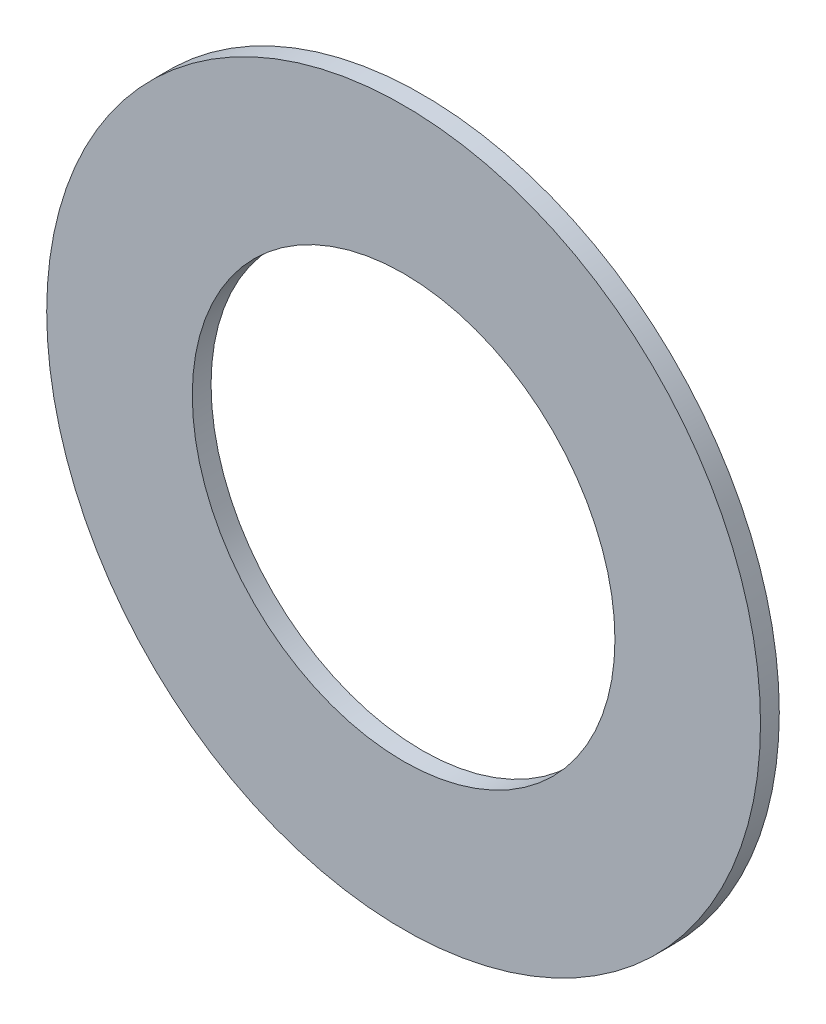
ISO-10303-21;
HEADER;
FILE_DESCRIPTION(('STEP AP214'),'2;1');
FILE_NAME('part.step','',(''),(''),'','','');
FILE_SCHEMA(('AUTOMOTIVE_DESIGN { 1 0 10303 214 1 1 1 1 }'));
ENDSEC;
DATA;
#1=APPLICATION_CONTEXT('core data for automotive mechanical design processes');
#2=APPLICATION_PROTOCOL_DEFINITION('international standard','automotive_design',2000,#1);
#3=PRODUCT_CONTEXT('',#1,'mechanical');
#4=PRODUCT('Part','Part','',(#3));
#5=PRODUCT_RELATED_PRODUCT_CATEGORY('part','',(#4));
#6=PRODUCT_DEFINITION_FORMATION('','',#4);
#7=PRODUCT_DEFINITION_CONTEXT('part definition',#1,'design');
#8=PRODUCT_DEFINITION('design','',#6,#7);
#9=PRODUCT_DEFINITION_SHAPE('','',#8);
#10=(LENGTH_UNIT() NAMED_UNIT(*) SI_UNIT(.MILLI.,.METRE.));
#11=(NAMED_UNIT(*) PLANE_ANGLE_UNIT() SI_UNIT($,.RADIAN.));
#12=(NAMED_UNIT(*) SI_UNIT($,.STERADIAN.) SOLID_ANGLE_UNIT());
#13=UNCERTAINTY_MEASURE_WITH_UNIT(LENGTH_MEASURE(1.E-05),#10,'distance_accuracy_value','');
#14=(GEOMETRIC_REPRESENTATION_CONTEXT(3) GLOBAL_UNCERTAINTY_ASSIGNED_CONTEXT((#13)) GLOBAL_UNIT_ASSIGNED_CONTEXT((#10,
#11,#12)) REPRESENTATION_CONTEXT('',''));
#15=CARTESIAN_POINT('',(0.,0.,0.));
#16=DIRECTION('',(0.,0.,1.));
#17=DIRECTION('',(1.,0.,0.));
#18=AXIS2_PLACEMENT_3D('',#15,#16,#17);
#19=CARTESIAN_POINT('',(0.,0.,1.));
#20=DIRECTION('',(0.,0.,1.));
#21=DIRECTION('',(1.,0.,0.));
#22=AXIS2_PLACEMENT_3D('',#19,#20,#21);
#23=PLANE('',#22);
#24=CARTESIAN_POINT('',(0.,0.,1.));
#25=DIRECTION('',(0.,0.,1.));
#26=DIRECTION('',(1.,0.,0.));
#27=AXIS2_PLACEMENT_3D('',#24,#25,#26);
#28=CIRCLE('',#27,19.);
#29=CARTESIAN_POINT('',(19.,0.,1.));
#30=VERTEX_POINT('',#29);
#31=EDGE_CURVE('E10',#30,#30,#28,.T.);
#32=ORIENTED_EDGE('',*,*,#31,.T.);
#33=EDGE_LOOP('',(#32));
#34=FACE_BOUND('',#33,.T.);
#35=CARTESIAN_POINT('',(0.,0.,1.));
#36=DIRECTION('',(0.,0.,1.));
#37=DIRECTION('',(1.,0.,0.));
#38=AXIS2_PLACEMENT_3D('',#35,#36,#37);
#39=CIRCLE('',#38,11.25);
#40=CARTESIAN_POINT('',(11.25,0.,1.));
#41=VERTEX_POINT('',#40);
#42=EDGE_CURVE('E42',#41,#41,#39,.T.);
#43=ORIENTED_EDGE('',*,*,#42,.F.);
#44=EDGE_LOOP('',(#43));
#45=FACE_BOUND('',#44,.T.);
#46=ADVANCED_FACE('F31',(#34,#45),#23,.T.);
#47=CARTESIAN_POINT('',(0.,0.,0.));
#48=DIRECTION('',(0.,0.,1.));
#49=DIRECTION('',(1.,0.,0.));
#50=AXIS2_PLACEMENT_3D('',#47,#48,#49);
#51=PLANE('',#50);
#52=CARTESIAN_POINT('',(0.,0.,0.));
#53=DIRECTION('',(0.,0.,1.));
#54=DIRECTION('',(1.,0.,0.));
#55=AXIS2_PLACEMENT_3D('',#52,#53,#54);
#56=CIRCLE('',#55,19.);
#57=CARTESIAN_POINT('',(19.,0.,0.));
#58=VERTEX_POINT('',#57);
#59=EDGE_CURVE('E35',#58,#58,#56,.T.);
#60=ORIENTED_EDGE('',*,*,#59,.F.);
#61=EDGE_LOOP('',(#60));
#62=FACE_BOUND('',#61,.T.);
#63=CARTESIAN_POINT('',(0.,0.,0.));
#64=DIRECTION('',(0.,0.,1.));
#65=DIRECTION('',(1.,0.,0.));
#66=AXIS2_PLACEMENT_3D('',#63,#64,#65);
#67=CIRCLE('',#66,11.25);
#68=CARTESIAN_POINT('',(11.25,0.,0.));
#69=VERTEX_POINT('',#68);
#70=EDGE_CURVE('E44',#69,#69,#67,.T.);
#71=ORIENTED_EDGE('',*,*,#70,.T.);
#72=EDGE_LOOP('',(#71));
#73=FACE_BOUND('',#72,.T.);
#74=ADVANCED_FACE('F54',(#62,#73),#51,.F.);
#75=CARTESIAN_POINT('',(0.,0.,1.));
#76=DIRECTION('',(0.,0.,-1.));
#77=DIRECTION('',(-1.,0.,0.));
#78=AXIS2_PLACEMENT_3D('',#75,#76,#77);
#79=CYLINDRICAL_SURFACE('',#78,19.);
#80=ORIENTED_EDGE('',*,*,#31,.F.);
#81=EDGE_LOOP('',(#80));
#82=FACE_BOUND('',#81,.T.);
#83=ORIENTED_EDGE('',*,*,#59,.T.);
#84=EDGE_LOOP('',(#83));
#85=FACE_BOUND('',#84,.T.);
#86=ADVANCED_FACE('F33',(#82,#85),#79,.T.);
#87=CARTESIAN_POINT('',(0.,0.,1.));
#88=DIRECTION('',(0.,0.,-1.));
#89=DIRECTION('',(-1.,0.,0.));
#90=AXIS2_PLACEMENT_3D('',#87,#88,#89);
#91=CYLINDRICAL_SURFACE('',#90,11.25);
#92=ORIENTED_EDGE('',*,*,#42,.T.);
#93=EDGE_LOOP('',(#92));
#94=FACE_BOUND('',#93,.T.);
#95=ORIENTED_EDGE('',*,*,#70,.F.);
#96=EDGE_LOOP('',(#95));
#97=FACE_BOUND('',#96,.T.);
#98=ADVANCED_FACE('F50',(#94,#97),#91,.F.);
#99=CLOSED_SHELL('',(#46,#74,#86,#98));
#100=MANIFOLD_SOLID_BREP('B2',#99);
#101=ADVANCED_BREP_SHAPE_REPRESENTATION('',(#18,#100),#14);
#102=SHAPE_DEFINITION_REPRESENTATION(#9,#101);
ENDSEC;
END-ISO-10303-21;
